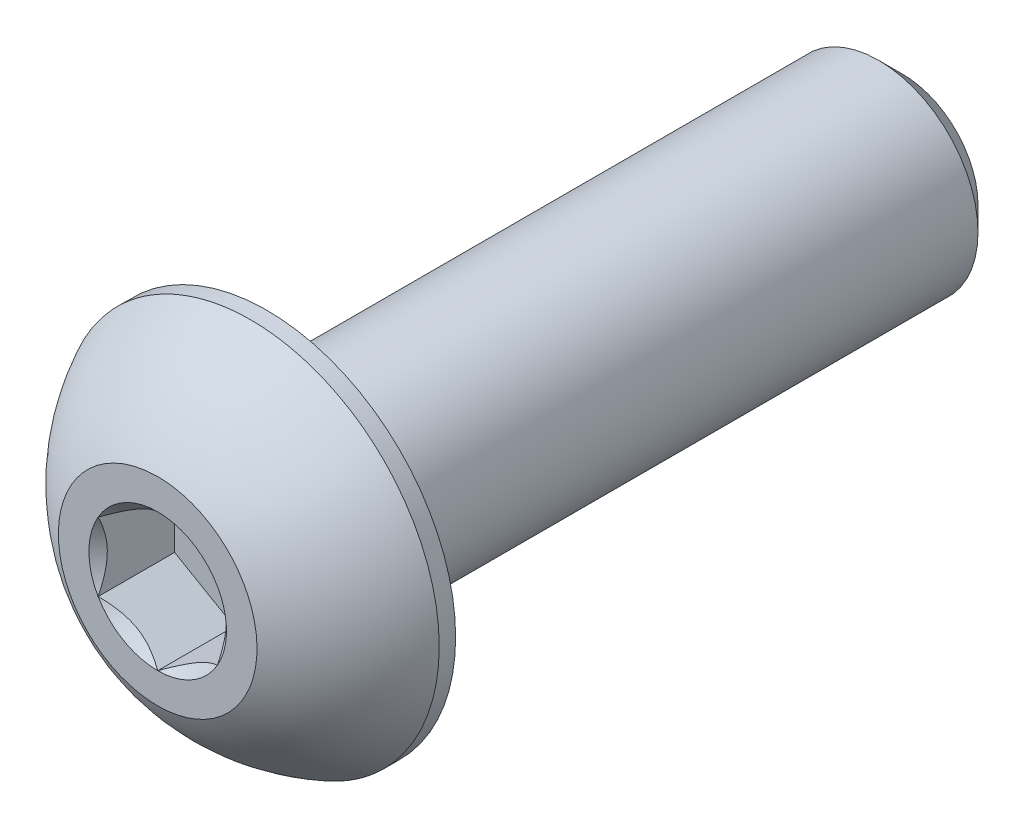
ISO-10303-21;
HEADER;
FILE_DESCRIPTION(('STEP AP214'),'2;1');
FILE_NAME('part.step','',(''),(''),'','','');
FILE_SCHEMA(('AUTOMOTIVE_DESIGN { 1 0 10303 214 1 1 1 1 }'));
ENDSEC;
DATA;
#1=APPLICATION_CONTEXT('core data for automotive mechanical design processes');
#2=APPLICATION_PROTOCOL_DEFINITION('international standard','automotive_design',2000,#1);
#3=PRODUCT_CONTEXT('',#1,'mechanical');
#4=PRODUCT('Part','Part','',(#3));
#5=PRODUCT_RELATED_PRODUCT_CATEGORY('part','',(#4));
#6=PRODUCT_DEFINITION_FORMATION('','',#4);
#7=PRODUCT_DEFINITION_CONTEXT('part definition',#1,'design');
#8=PRODUCT_DEFINITION('design','',#6,#7);
#9=PRODUCT_DEFINITION_SHAPE('','',#8);
#10=(LENGTH_UNIT() NAMED_UNIT(*) SI_UNIT(.MILLI.,.METRE.));
#11=(NAMED_UNIT(*) PLANE_ANGLE_UNIT() SI_UNIT($,.RADIAN.));
#12=(NAMED_UNIT(*) SI_UNIT($,.STERADIAN.) SOLID_ANGLE_UNIT());
#13=UNCERTAINTY_MEASURE_WITH_UNIT(LENGTH_MEASURE(1.E-05),#10,'distance_accuracy_value','');
#14=(GEOMETRIC_REPRESENTATION_CONTEXT(3) GLOBAL_UNCERTAINTY_ASSIGNED_CONTEXT((#13)) GLOBAL_UNIT_ASSIGNED_CONTEXT((#10,
#11,#12)) REPRESENTATION_CONTEXT('',''));
#15=CARTESIAN_POINT('',(0.,0.,0.));
#16=DIRECTION('',(0.,0.,1.));
#17=DIRECTION('',(1.,0.,0.));
#18=AXIS2_PLACEMENT_3D('',#15,#16,#17);
#19=CARTESIAN_POINT('',(1.5,-0.866025403784438,-1.925));
#20=DIRECTION('',(0.,0.,1.));
#21=DIRECTION('',(1.,0.,0.));
#22=AXIS2_PLACEMENT_3D('',#19,#20,#21);
#23=PLANE('',#22);
#24=DIRECTION('',(0.,1.,0.));
#25=VECTOR('',#24,1.);
#26=CARTESIAN_POINT('',(-1.5,0.866025403784438,-1.925));
#27=LINE('',#26,#25);
#28=CARTESIAN_POINT('',(-1.5,0.866025403784439,-1.925));
#29=VERTEX_POINT('',#28);
#30=CARTESIAN_POINT('',(-1.5,-0.866025403784439,-1.925));
#31=VERTEX_POINT('',#30);
#32=EDGE_CURVE('E67',#29,#31,#27,.F.);
#33=ORIENTED_EDGE('',*,*,#32,.T.);
#34=DIRECTION('',(0.866025403784439,-0.5,0.));
#35=VECTOR('',#34,1.);
#36=CARTESIAN_POINT('',(-1.5,-0.866025403784439,-1.925));
#37=LINE('',#36,#35);
#38=CARTESIAN_POINT('',(0.,-1.73205080756888,-1.925));
#39=VERTEX_POINT('',#38);
#40=EDGE_CURVE('E81',#31,#39,#37,.T.);
#41=ORIENTED_EDGE('',*,*,#40,.T.);
#42=DIRECTION('',(0.866025403784438,0.5,0.));
#43=VECTOR('',#42,1.);
#44=CARTESIAN_POINT('',(0.,-1.73205080756888,-1.925));
#45=LINE('',#44,#43);
#46=CARTESIAN_POINT('',(1.5,-0.866025403784439,-1.925));
#47=VERTEX_POINT('',#46);
#48=EDGE_CURVE('E84',#39,#47,#45,.T.);
#49=ORIENTED_EDGE('',*,*,#48,.T.);
#50=DIRECTION('',(0.,1.,0.));
#51=VECTOR('',#50,1.);
#52=CARTESIAN_POINT('',(1.5,-0.866025403784438,-1.925));
#53=LINE('',#52,#51);
#54=CARTESIAN_POINT('',(1.5,0.866025403784439,-1.925));
#55=VERTEX_POINT('',#54);
#56=EDGE_CURVE('E93',#47,#55,#53,.T.);
#57=ORIENTED_EDGE('',*,*,#56,.T.);
#58=DIRECTION('',(-0.866025403784439,0.5,0.));
#59=VECTOR('',#58,1.);
#60=CARTESIAN_POINT('',(1.5,0.866025403784439,-1.925));
#61=LINE('',#60,#59);
#62=CARTESIAN_POINT('',(0.,1.73205080756888,-1.925));
#63=VERTEX_POINT('',#62);
#64=EDGE_CURVE('E265',#55,#63,#61,.T.);
#65=ORIENTED_EDGE('',*,*,#64,.T.);
#66=DIRECTION('',(-0.866025403784438,-0.5,0.));
#67=VECTOR('',#66,1.);
#68=CARTESIAN_POINT('',(0.,1.73205080756888,-1.925));
#69=LINE('',#68,#67);
#70=EDGE_CURVE('E72',#63,#29,#69,.T.);
#71=ORIENTED_EDGE('',*,*,#70,.T.);
#72=EDGE_LOOP('',(#33,#41,#49,#57,#65,#71));
#73=FACE_BOUND('',#72,.T.);
#74=ADVANCED_FACE('F17',(#73),#23,.T.);
#75=CARTESIAN_POINT('',(-1.5,-0.866025403784439,-1.925));
#76=DIRECTION('',(-0.5,-0.866025403784439,0.));
#77=DIRECTION('',(0.866025403784439,-0.5,0.));
#78=AXIS2_PLACEMENT_3D('',#75,#76,#77);
#79=PLANE('',#78);
#80=CARTESIAN_POINT('',(-1.50000000002453,-0.866025403770048,-3.49730883349403E-11));
#81=CARTESIAN_POINT('',(-1.44844426727117,-0.895791119953617,-0.0297371504849993));
#82=CARTESIAN_POINT('',(-1.39602652187328,-0.926054519369461,-0.0577274997332096));
#83=CARTESIAN_POINT('',(-1.28914135977816,-0.9877646964775,-0.108976634295228));
#84=CARTESIAN_POINT('',(-1.23466378385068,-1.01921733960401,-0.132206913925155));
#85=CARTESIAN_POINT('',(-1.12481242363947,-1.08264005199279,-0.172000539063643));
#86=CARTESIAN_POINT('',(-1.06946660011449,-1.11459397810346,-0.188663877355987));
#87=CARTESIAN_POINT('',(-0.95755685533188,-1.17920509937865,-0.214336924391904));
#88=CARTESIAN_POINT('',(-0.900996350293105,-1.21186032218828,-0.223365789908325));
#89=CARTESIAN_POINT('',(-0.803509072843295,-1.26814462806649,-0.231512589340654));
#90=CARTESIAN_POINT('',(-0.762708138141556,-1.29170105869973,-0.232718117543908));
#91=CARTESIAN_POINT('',(-0.68117834074718,-1.33877230917235,-0.230683861819339));
#92=CARTESIAN_POINT('',(-0.640449495964758,-1.36228711867126,-0.22744309593466));
#93=CARTESIAN_POINT('',(-0.559384065201953,-1.40909026694414,-0.216702694706976));
#94=CARTESIAN_POINT('',(-0.51904787950441,-1.4323783746147,-0.20919909909419));
#95=CARTESIAN_POINT('',(-0.439052551258332,-1.47856369891149,-0.19034052638936));
#96=CARTESIAN_POINT('',(-0.399393706909126,-1.50146074337225,-0.178983896683506));
#97=CARTESIAN_POINT('',(-0.297850129661508,-1.56008695503064,-0.145281418581615));
#98=CARTESIAN_POINT('',(-0.236594120185608,-1.59545312859103,-0.120399016466317));
#99=CARTESIAN_POINT('',(-0.146523888893023,-1.64745520087378,-0.0783962697862533));
#100=CARTESIAN_POINT('',(-0.116842951449675,-1.6645914980965,-0.0636393457173694));
#101=CARTESIAN_POINT('',(-0.0580266310224323,-1.69854911652791,-0.0327784720806824));
#102=CARTESIAN_POINT('',(-0.0288909964375011,-1.71537058299853,-0.0166751634684283));
#103=CARTESIAN_POINT('',(2.46562120663875E-11,-1.73205080758311,-3.5066995750627E-11));
#104=B_SPLINE_CURVE_WITH_KNOTS('',3,(#80,#81,#82,#83,#84,#85,#86,#87,#88,#89,#90,#91,#92,#93,
#94,#95,#96,#97,#98,#99,#100,#101,#102,#103),.UNSPECIFIED.,.F.,.F.,(4,2,2,2,2,2,2,2,2,2,2,4),
(0.,0.199774419910088,0.4007123122777,0.598459990337994,0.795709985707602,0.936894690871223,
1.07811058146816,1.21945788001607,1.36086588096647,1.58533909988034,1.69726364731887,
1.80913521242832),.UNSPECIFIED.);
#105=CARTESIAN_POINT('',(-1.50000000002135,-0.866025403796764,-2.4651077774769E-11));
#106=VERTEX_POINT('',#105);
#107=CARTESIAN_POINT('',(-3.03592605946672E-11,-1.73205080760065,-1.75295343369276E-11));
#108=VERTEX_POINT('',#107);
#109=EDGE_CURVE('E20',#106,#108,#104,.T.);
#110=ORIENTED_EDGE('',*,*,#109,.T.);
#111=DIRECTION('',(0.,0.,1.));
#112=VECTOR('',#111,1.);
#113=CARTESIAN_POINT('',(0.,-1.73205080756888,-1.925));
#114=LINE('',#113,#112);
#115=EDGE_CURVE('E88',#108,#39,#114,.F.);
#116=ORIENTED_EDGE('',*,*,#115,.T.);
#117=ORIENTED_EDGE('',*,*,#40,.F.);
#118=DIRECTION('',(0.,0.,1.));
#119=VECTOR('',#118,1.);
#120=CARTESIAN_POINT('',(-1.5,-0.866025403784439,-1.925));
#121=LINE('',#120,#119);
#122=EDGE_CURVE('E59',#31,#106,#121,.T.);
#123=ORIENTED_EDGE('',*,*,#122,.T.);
#124=EDGE_LOOP('',(#110,#116,#117,#123));
#125=FACE_BOUND('',#124,.T.);
#126=ADVANCED_FACE('F89',(#125),#79,.F.);
#127=CARTESIAN_POINT('',(0.,-1.73205080756888,-1.925));
#128=DIRECTION('',(0.5,-0.866025403784438,0.));
#129=DIRECTION('',(0.866025403784438,0.5,0.));
#130=AXIS2_PLACEMENT_3D('',#127,#128,#129);
#131=PLANE('',#130);
#132=CARTESIAN_POINT('',(-2.47283241622989E-11,-1.73205080758293,-3.49712886177983E-11));
#133=CARTESIAN_POINT('',(0.0515557327287634,-1.70228509139958,-0.0297371504849972));
#134=CARTESIAN_POINT('',(0.103973478126704,-1.67202169198382,-0.0577274997332075));
#135=CARTESIAN_POINT('',(0.210858640221864,-1.61031151487585,-0.108976634295226));
#136=CARTESIAN_POINT('',(0.265336216149329,-1.57885887174931,-0.132206913925153));
#137=CARTESIAN_POINT('',(0.375187576360524,-1.51543615936052,-0.172000539063641));
#138=CARTESIAN_POINT('',(0.430533399885509,-1.48348223324986,-0.188663877355984));
#139=CARTESIAN_POINT('',(0.542443144668122,-1.41887111197467,-0.214336924391901));
#140=CARTESIAN_POINT('',(0.599003649706896,-1.38621588916504,-0.223365789908323));
#141=CARTESIAN_POINT('',(0.696490927156706,-1.32993158328682,-0.231512589340651));
#142=CARTESIAN_POINT('',(0.737291861858445,-1.30637515265359,-0.232718117543906));
#143=CARTESIAN_POINT('',(0.818821659252821,-1.25930390218097,-0.230683861819337));
#144=CARTESIAN_POINT('',(0.859550504035243,-1.23578909268205,-0.227443095934658));
#145=CARTESIAN_POINT('',(0.940615934798048,-1.18898594440918,-0.216702694706974));
#146=CARTESIAN_POINT('',(0.980952120495591,-1.16569783673862,-0.209199099094188));
#147=CARTESIAN_POINT('',(1.06094744874167,-1.11951251244183,-0.190340526389358));
#148=CARTESIAN_POINT('',(1.10060629309087,-1.09661546798107,-0.178983896683504));
#149=CARTESIAN_POINT('',(1.20214987033849,-1.03798925632268,-0.145281418581614));
#150=CARTESIAN_POINT('',(1.26340587981439,-1.00262308276228,-0.120399016466316));
#151=CARTESIAN_POINT('',(1.35347611110698,-0.950621010479539,-0.0783962697862523));
#152=CARTESIAN_POINT('',(1.38315704855032,-0.933484713256822,-0.0636393457173685));
#153=CARTESIAN_POINT('',(1.44197336897757,-0.89952709482541,-0.0327784720806818));
#154=CARTESIAN_POINT('',(1.4711090035625,-0.882705628354789,-0.0166751634684277));
#155=CARTESIAN_POINT('',(1.50000000002466,-0.866025403770206,-3.50662371950392E-11));
#156=B_SPLINE_CURVE_WITH_KNOTS('',3,(#132,#133,#134,#135,#136,#137,#138,#139,#140,#141,#142,
#143,#144,#145,#146,#147,#148,#149,#150,#151,#152,#153,#154,#155),.UNSPECIFIED.,.F.,.F.,(4,2,2,
2,2,2,2,2,2,2,2,4),(0.,0.199774419910088,0.400712312277699,0.598459990337993,0.795709985707601,
0.936894690871222,1.07811058146816,1.21945788001607,1.36086588096647,1.58533909988034,
1.69726364731887,1.80913521242832),.UNSPECIFIED.);
#157=CARTESIAN_POINT('',(1.50000000001233,-0.866025403826621,-1.7529131224469E-11));
#158=VERTEX_POINT('',#157);
#159=EDGE_CURVE('E202',#108,#158,#156,.T.);
#160=ORIENTED_EDGE('',*,*,#159,.T.);
#161=DIRECTION('',(0.,0.,-1.));
#162=VECTOR('',#161,1.);
#163=CARTESIAN_POINT('',(1.5,-0.866025403784439,-1.925));
#164=LINE('',#163,#162);
#165=EDGE_CURVE('E97',#158,#47,#164,.T.);
#166=ORIENTED_EDGE('',*,*,#165,.T.);
#167=ORIENTED_EDGE('',*,*,#48,.F.);
#168=ORIENTED_EDGE('',*,*,#115,.F.);
#169=EDGE_LOOP('',(#160,#166,#167,#168));
#170=FACE_BOUND('',#169,.T.);
#171=ADVANCED_FACE('F95',(#170),#131,.F.);
#172=CARTESIAN_POINT('',(1.5,-0.866025403784438,-1.925));
#173=DIRECTION('',(1.,0.,0.));
#174=DIRECTION('',(0.,0.,-1.));
#175=AXIS2_PLACEMENT_3D('',#172,#173,#174);
#176=PLANE('',#175);
#177=CARTESIAN_POINT('',(1.4999999999998,-0.866025403812882,-3.49731948477309E-11));
#178=CARTESIAN_POINT('',(1.49999999999993,-0.806493971458483,-0.0297371504859726));
#179=CARTESIAN_POINT('',(1.49999999999998,-0.745967172639481,-0.0577274997356718));
#180=CARTESIAN_POINT('',(1.50000000000002,-0.622546818448653,-0.108976634302055));
#181=CARTESIAN_POINT('',(1.50000000000001,-0.559641532208188,-0.132206913934862));
#182=CARTESIAN_POINT('',(1.5,-0.432796107455125,-0.172000539080811));
#183=CARTESIAN_POINT('',(1.5,-0.368888255245699,-0.188663877377684));
#184=CARTESIAN_POINT('',(1.5,-0.239666012718551,-0.214336924424236));
#185=CARTESIAN_POINT('',(1.5,-0.174355567110582,-0.223365789946761));
#186=CARTESIAN_POINT('',(1.5,-0.0617869553803679,-0.231512589389946));
#187=CARTESIAN_POINT('',(1.5,-0.0146740941290628,-0.232718117598397));
#188=CARTESIAN_POINT('',(1.5,0.0794684067864031,-0.230683861885897));
#189=CARTESIAN_POINT('',(1.5,0.126498025769629,-0.227443096008093));
#190=CARTESIAN_POINT('',(1.5,0.22010432228685,-0.21670269479537));
#191=CARTESIAN_POINT('',(1.5,0.266680537614034,-0.209199099190673));
#192=CARTESIAN_POINT('',(1.5,0.359051186180354,-0.190340526502742));
#193=CARTESIAN_POINT('',(1.5,0.404845275088565,-0.178983896805698));
#194=CARTESIAN_POINT('',(1.5,0.522097698449399,-0.145281418704612));
#195=CARTESIAN_POINT('',(1.5,0.592830045625335,-0.120399016572433));
#196=CARTESIAN_POINT('',(1.5,0.69683419026976,-0.0783962698582894));
#197=CARTESIAN_POINT('',(1.5,0.731106784740956,-0.0636393457765502));
#198=CARTESIAN_POINT('',(1.5,0.799022021654026,-0.0327784721118594));
#199=CARTESIAN_POINT('',(1.5,0.832664954619755,-0.0166751634844621));
#200=CARTESIAN_POINT('',(1.5,0.866025403812908,-3.5067301240063E-11));
#201=B_SPLINE_CURVE_WITH_KNOTS('',3,(#177,#178,#179,#180,#181,#182,#183,#184,#185,#186,#187,
#188,#189,#190,#191,#192,#193,#194,#195,#196,#197,#198,#199,#200),.UNSPECIFIED.,.F.,.F.,(4,2,2,
2,2,2,2,2,2,2,2,4),(0.,0.199774419877746,0.400712312213007,0.598459990242251,0.795709985580833,
0.936894690699465,1.07811058125136,1.21945787975417,1.36086588065946,1.58533909974464,
1.69726364726936,1.80913521246463),.UNSPECIFIED.);
#202=CARTESIAN_POINT('',(1.5000000000427,0.866025403774031,-1.75296331798823E-11));
#203=VERTEX_POINT('',#202);
#204=EDGE_CURVE('E184',#158,#203,#201,.T.);
#205=ORIENTED_EDGE('',*,*,#204,.T.);
#206=DIRECTION('',(0.,0.,1.));
#207=VECTOR('',#206,1.);
#208=CARTESIAN_POINT('',(1.5,0.866025403784439,-1.925));
#209=LINE('',#208,#207);
#210=EDGE_CURVE('E262',#203,#55,#209,.F.);
#211=ORIENTED_EDGE('',*,*,#210,.T.);
#212=ORIENTED_EDGE('',*,*,#56,.F.);
#213=ORIENTED_EDGE('',*,*,#165,.F.);
#214=EDGE_LOOP('',(#205,#211,#212,#213));
#215=FACE_BOUND('',#214,.T.);
#216=ADVANCED_FACE('F174',(#215),#176,.F.);
#217=CARTESIAN_POINT('',(1.5,0.866025403784439,-1.925));
#218=DIRECTION('',(0.5,0.866025403784439,0.));
#219=DIRECTION('',(-0.866025403784439,0.5,0.));
#220=AXIS2_PLACEMENT_3D('',#217,#218,#219);
#221=PLANE('',#220);
#222=CARTESIAN_POINT('',(1.50000000002453,0.866025403770048,-3.4973253111955E-11));
#223=CARTESIAN_POINT('',(1.44844426727117,0.895791119953617,-0.0297371504849994));
#224=CARTESIAN_POINT('',(1.39602652187328,0.926054519369461,-0.0577274997332097));
#225=CARTESIAN_POINT('',(1.28914135977816,0.987764696477501,-0.108976634295228));
#226=CARTESIAN_POINT('',(1.23466378385068,1.01921733960401,-0.132206913925155));
#227=CARTESIAN_POINT('',(1.12481242363947,1.08264005199279,-0.172000539063643));
#228=CARTESIAN_POINT('',(1.06946660011449,1.11459397810346,-0.188663877355987));
#229=CARTESIAN_POINT('',(0.95755685533188,1.17920509937865,-0.214336924391904));
#230=CARTESIAN_POINT('',(0.900996350293104,1.21186032218828,-0.223365789908325));
#231=CARTESIAN_POINT('',(0.803509072843295,1.26814462806649,-0.231512589340654));
#232=CARTESIAN_POINT('',(0.762708138141556,1.29170105869973,-0.232718117543908));
#233=CARTESIAN_POINT('',(0.68117834074718,1.33877230917235,-0.230683861819339));
#234=CARTESIAN_POINT('',(0.640449495964758,1.36228711867126,-0.22744309593466));
#235=CARTESIAN_POINT('',(0.559384065201953,1.40909026694414,-0.216702694706976));
#236=CARTESIAN_POINT('',(0.51904787950441,1.4323783746147,-0.20919909909419));
#237=CARTESIAN_POINT('',(0.439052551258333,1.47856369891149,-0.19034052638936));
#238=CARTESIAN_POINT('',(0.399393706909126,1.50146074337225,-0.178983896683506));
#239=CARTESIAN_POINT('',(0.297850129661507,1.56008695503064,-0.145281418581616));
#240=CARTESIAN_POINT('',(0.236594120185608,1.59545312859103,-0.120399016466317));
#241=CARTESIAN_POINT('',(0.146523888893023,1.64745520087378,-0.0783962697862531));
#242=CARTESIAN_POINT('',(0.116842951449674,1.6645914980965,-0.0636393457173692));
#243=CARTESIAN_POINT('',(0.0580266310224316,1.69854911652791,-0.0327784720806821));
#244=CARTESIAN_POINT('',(0.0288909964375004,1.71537058299853,-0.0166751634684281));
#245=CARTESIAN_POINT('',(-2.46568834570738E-11,1.73205080758311,-3.50665978158375E-11));
#246=B_SPLINE_CURVE_WITH_KNOTS('',3,(#222,#223,#224,#225,#226,#227,#228,#229,#230,#231,#232,
#233,#234,#235,#236,#237,#238,#239,#240,#241,#242,#243,#244,#245),.UNSPECIFIED.,.F.,.F.,(4,2,2,
2,2,2,2,2,2,2,2,4),(0.,0.199774419910088,0.400712312277699,0.598459990337994,0.795709985707602,
0.936894690871222,1.07811058146816,1.21945788001607,1.36086588096647,1.58533909988034,
1.69726364731887,1.80913521242832),.UNSPECIFIED.);
#247=CARTESIAN_POINT('',(3.03590397906963E-11,1.73205080760065,-1.75294164449582E-11));
#248=VERTEX_POINT('',#247);
#249=EDGE_CURVE('E178',#203,#248,#246,.T.);
#250=ORIENTED_EDGE('',*,*,#249,.T.);
#251=DIRECTION('',(0.,0.,1.));
#252=VECTOR('',#251,1.);
#253=CARTESIAN_POINT('',(0.,1.73205080756888,-1.925));
#254=LINE('',#253,#252);
#255=EDGE_CURVE('E257',#248,#63,#254,.F.);
#256=ORIENTED_EDGE('',*,*,#255,.T.);
#257=ORIENTED_EDGE('',*,*,#64,.F.);
#258=ORIENTED_EDGE('',*,*,#210,.F.);
#259=EDGE_LOOP('',(#250,#256,#257,#258));
#260=FACE_BOUND('',#259,.T.);
#261=ADVANCED_FACE('F170',(#260),#221,.F.);
#262=CARTESIAN_POINT('',(0.,1.73205080756888,-1.925));
#263=DIRECTION('',(-0.5,0.866025403784438,0.));
#264=DIRECTION('',(-0.866025403784438,-0.5,0.));
#265=AXIS2_PLACEMENT_3D('',#262,#263,#264);
#266=PLANE('',#265);
#267=CARTESIAN_POINT('',(2.47278634993487E-11,1.73205080758293,-3.49716904690521E-11));
#268=CARTESIAN_POINT('',(-0.0515557327287638,1.70228509139958,-0.0297371504849977));
#269=CARTESIAN_POINT('',(-0.103973478126705,1.67202169198382,-0.0577274997332079));
#270=CARTESIAN_POINT('',(-0.210858640221864,1.61031151487585,-0.108976634295226));
#271=CARTESIAN_POINT('',(-0.26533621614933,1.57885887174931,-0.132206913925153));
#272=CARTESIAN_POINT('',(-0.375187576360525,1.51543615936052,-0.172000539063641));
#273=CARTESIAN_POINT('',(-0.430533399885509,1.48348223324986,-0.188663877355985));
#274=CARTESIAN_POINT('',(-0.542443144668123,1.41887111197467,-0.214336924391901));
#275=CARTESIAN_POINT('',(-0.599003649706897,1.38621588916504,-0.223365789908323));
#276=CARTESIAN_POINT('',(-0.696490927156706,1.32993158328682,-0.231512589340651));
#277=CARTESIAN_POINT('',(-0.737291861858445,1.30637515265359,-0.232718117543906));
#278=CARTESIAN_POINT('',(-0.818821659252822,1.25930390218097,-0.230683861819337));
#279=CARTESIAN_POINT('',(-0.859550504035244,1.23578909268205,-0.227443095934658));
#280=CARTESIAN_POINT('',(-0.940615934798048,1.18898594440918,-0.216702694706974));
#281=CARTESIAN_POINT('',(-0.980952120495591,1.16569783673862,-0.209199099094188));
#282=CARTESIAN_POINT('',(-1.06094744874167,1.11951251244183,-0.190340526389358));
#283=CARTESIAN_POINT('',(-1.10060629309088,1.09661546798107,-0.178983896683504));
#284=CARTESIAN_POINT('',(-1.20214987033849,1.03798925632268,-0.145281418581613));
#285=CARTESIAN_POINT('',(-1.26340587981439,1.00262308276228,-0.120399016466315));
#286=CARTESIAN_POINT('',(-1.35347611110698,0.950621010479539,-0.0783962697862516));
#287=CARTESIAN_POINT('',(-1.38315704855033,0.933484713256821,-0.0636393457173678));
#288=CARTESIAN_POINT('',(-1.44197336897757,0.899527094825409,-0.0327784720806811));
#289=CARTESIAN_POINT('',(-1.4711090035625,0.882705628354789,-0.0166751634684272));
#290=CARTESIAN_POINT('',(-1.50000000002466,0.866025403770206,-3.50659196153753E-11));
#291=B_SPLINE_CURVE_WITH_KNOTS('',3,(#267,#268,#269,#270,#271,#272,#273,#274,#275,#276,#277,
#278,#279,#280,#281,#282,#283,#284,#285,#286,#287,#288,#289,#290),.UNSPECIFIED.,.F.,.F.,(4,2,2,
2,2,2,2,2,2,2,2,4),(0.,0.199774419910088,0.400712312277699,0.598459990337993,0.795709985707601,
0.936894690871222,1.07811058146816,1.21945788001607,1.36086588096647,1.58533909988034,
1.69726364731887,1.80913521242832),.UNSPECIFIED.);
#292=CARTESIAN_POINT('',(-1.50000000001233,0.86602540382662,-1.75290210342841E-11));
#293=VERTEX_POINT('',#292);
#294=EDGE_CURVE('E40',#248,#293,#291,.T.);
#295=ORIENTED_EDGE('',*,*,#294,.T.);
#296=DIRECTION('',(0.,0.,1.));
#297=VECTOR('',#296,1.);
#298=CARTESIAN_POINT('',(-1.5,0.866025403784438,-1.925));
#299=LINE('',#298,#297);
#300=EDGE_CURVE('E250',#293,#29,#299,.F.);
#301=ORIENTED_EDGE('',*,*,#300,.T.);
#302=ORIENTED_EDGE('',*,*,#70,.F.);
#303=ORIENTED_EDGE('',*,*,#255,.F.);
#304=EDGE_LOOP('',(#295,#301,#302,#303));
#305=FACE_BOUND('',#304,.T.);
#306=ADVANCED_FACE('F163',(#305),#266,.F.);
#307=CARTESIAN_POINT('',(-1.5,0.866025403784438,-1.925));
#308=DIRECTION('',(-1.,0.,0.));
#309=DIRECTION('',(0.,0.,1.));
#310=AXIS2_PLACEMENT_3D('',#307,#308,#309);
#311=PLANE('',#310);
#312=CARTESIAN_POINT('',(-1.4999999999998,0.866025403812881,-3.49736894377255E-11));
#313=CARTESIAN_POINT('',(-1.49999999999993,0.806493971458482,-0.0297371504859727));
#314=CARTESIAN_POINT('',(-1.49999999999998,0.74596717263948,-0.0577274997356719));
#315=CARTESIAN_POINT('',(-1.50000000000002,0.622546818448652,-0.108976634302056));
#316=CARTESIAN_POINT('',(-1.50000000000001,0.559641532208187,-0.132206913934863));
#317=CARTESIAN_POINT('',(-1.5,0.432796107455124,-0.172000539080812));
#318=CARTESIAN_POINT('',(-1.5,0.368888255245698,-0.188663877377684));
#319=CARTESIAN_POINT('',(-1.5,0.23966601271855,-0.214336924424236));
#320=CARTESIAN_POINT('',(-1.5,0.174355567110582,-0.223365789946761));
#321=CARTESIAN_POINT('',(-1.5,0.0617869553803675,-0.231512589389946));
#322=CARTESIAN_POINT('',(-1.5,0.0146740941290625,-0.232718117598397));
#323=CARTESIAN_POINT('',(-1.5,-0.0794684067864032,-0.230683861885897));
#324=CARTESIAN_POINT('',(-1.5,-0.126498025769629,-0.227443096008093));
#325=CARTESIAN_POINT('',(-1.5,-0.22010432228685,-0.21670269479537));
#326=CARTESIAN_POINT('',(-1.5,-0.266680537614034,-0.209199099190673));
#327=CARTESIAN_POINT('',(-1.5,-0.359051186180354,-0.190340526502742));
#328=CARTESIAN_POINT('',(-1.5,-0.404845275088566,-0.178983896805698));
#329=CARTESIAN_POINT('',(-1.5,-0.522097698449399,-0.145281418704612));
#330=CARTESIAN_POINT('',(-1.5,-0.592830045625335,-0.120399016572433));
#331=CARTESIAN_POINT('',(-1.5,-0.69683419026976,-0.0783962698582894));
#332=CARTESIAN_POINT('',(-1.5,-0.731106784740956,-0.0636393457765503));
#333=CARTESIAN_POINT('',(-1.5,-0.799022021654026,-0.0327784721118596));
#334=CARTESIAN_POINT('',(-1.5,-0.832664954619755,-0.0166751634844622));
#335=CARTESIAN_POINT('',(-1.5,-0.866025403812908,-3.50673251714009E-11));
#336=B_SPLINE_CURVE_WITH_KNOTS('',3,(#312,#313,#314,#315,#316,#317,#318,#319,#320,#321,#322,
#323,#324,#325,#326,#327,#328,#329,#330,#331,#332,#333,#334,#335),.UNSPECIFIED.,.F.,.F.,(4,2,2,
2,2,2,2,2,2,2,2,4),(0.,0.199774419877746,0.400712312213007,0.598459990242251,0.795709985580833,
0.936894690699464,1.07811058125136,1.21945787975417,1.36086588065945,1.58533909974464,
1.69726364726936,1.80913521246463),.UNSPECIFIED.);
#337=EDGE_CURVE('E143',#293,#106,#336,.T.);
#338=ORIENTED_EDGE('',*,*,#337,.T.);
#339=ORIENTED_EDGE('',*,*,#122,.F.);
#340=ORIENTED_EDGE('',*,*,#32,.F.);
#341=ORIENTED_EDGE('',*,*,#300,.F.);
#342=EDGE_LOOP('',(#338,#339,#340,#341));
#343=FACE_BOUND('',#342,.T.);
#344=ADVANCED_FACE('F159',(#343),#311,.F.);
#345=CARTESIAN_POINT('',(0.,0.,0.));
#346=DIRECTION('',(0.,0.,1.));
#347=DIRECTION('',(1.,0.,0.));
#348=AXIS2_PLACEMENT_3D('',#345,#346,#347);
#349=CONICAL_SURFACE('',#348,1.73205080761818,0.785398163519197);
#350=ORIENTED_EDGE('',*,*,#109,.F.);
#351=CARTESIAN_POINT('',(0.,0.,0.));
#352=DIRECTION('',(0.,0.,1.));
#353=DIRECTION('',(1.,0.,0.));
#354=AXIS2_PLACEMENT_3D('',#351,#352,#353);
#355=CIRCLE('',#354,1.73205080761818);
#356=EDGE_CURVE('E151',#106,#108,#355,.T.);
#357=ORIENTED_EDGE('',*,*,#356,.T.);
#358=EDGE_LOOP('',(#350,#357));
#359=FACE_BOUND('',#358,.T.);
#360=ADVANCED_FACE('F162',(#359),#349,.F.);
#361=CARTESIAN_POINT('',(0.,0.,0.));
#362=DIRECTION('',(0.,0.,1.));
#363=DIRECTION('',(1.,0.,0.));
#364=AXIS2_PLACEMENT_3D('',#361,#362,#363);
#365=CONICAL_SURFACE('',#364,1.73205080761818,0.785398163519197);
#366=ORIENTED_EDGE('',*,*,#159,.F.);
#367=CARTESIAN_POINT('',(0.,0.,0.));
#368=DIRECTION('',(0.,0.,1.));
#369=DIRECTION('',(1.,0.,0.));
#370=AXIS2_PLACEMENT_3D('',#367,#368,#369);
#371=CIRCLE('',#370,1.73205080761818);
#372=EDGE_CURVE('E303',#108,#158,#371,.T.);
#373=ORIENTED_EDGE('',*,*,#372,.T.);
#374=EDGE_LOOP('',(#366,#373));
#375=FACE_BOUND('',#374,.T.);
#376=ADVANCED_FACE('F197',(#375),#365,.F.);
#377=CARTESIAN_POINT('',(0.,0.,0.));
#378=DIRECTION('',(0.,0.,1.));
#379=DIRECTION('',(1.,0.,0.));
#380=AXIS2_PLACEMENT_3D('',#377,#378,#379);
#381=CONICAL_SURFACE('',#380,1.73205080761818,0.785398163397448);
#382=CARTESIAN_POINT('',(0.,0.,0.));
#383=DIRECTION('',(0.,0.,1.));
#384=DIRECTION('',(1.,0.,0.));
#385=AXIS2_PLACEMENT_3D('',#382,#383,#384);
#386=CIRCLE('',#385,1.73205080761818);
#387=EDGE_CURVE('E304',#158,#203,#386,.T.);
#388=ORIENTED_EDGE('',*,*,#387,.T.);
#389=ORIENTED_EDGE('',*,*,#204,.F.);
#390=EDGE_LOOP('',(#388,#389));
#391=FACE_BOUND('',#390,.T.);
#392=ADVANCED_FACE('F193',(#391),#381,.F.);
#393=CARTESIAN_POINT('',(0.,0.,0.));
#394=DIRECTION('',(0.,0.,1.));
#395=DIRECTION('',(1.,0.,0.));
#396=AXIS2_PLACEMENT_3D('',#393,#394,#395);
#397=CONICAL_SURFACE('',#396,1.73205080761818,0.785398163519197);
#398=ORIENTED_EDGE('',*,*,#249,.F.);
#399=CARTESIAN_POINT('',(0.,0.,0.));
#400=DIRECTION('',(0.,0.,1.));
#401=DIRECTION('',(1.,0.,0.));
#402=AXIS2_PLACEMENT_3D('',#399,#400,#401);
#403=CIRCLE('',#402,1.73205080761818);
#404=EDGE_CURVE('E305',#203,#248,#403,.T.);
#405=ORIENTED_EDGE('',*,*,#404,.T.);
#406=EDGE_LOOP('',(#398,#405));
#407=FACE_BOUND('',#406,.T.);
#408=ADVANCED_FACE('F190',(#407),#397,.F.);
#409=CARTESIAN_POINT('',(0.,0.,0.));
#410=DIRECTION('',(0.,0.,1.));
#411=DIRECTION('',(1.,0.,0.));
#412=AXIS2_PLACEMENT_3D('',#409,#410,#411);
#413=CONICAL_SURFACE('',#412,1.73205080761818,0.785398163519197);
#414=ORIENTED_EDGE('',*,*,#294,.F.);
#415=CARTESIAN_POINT('',(0.,0.,0.));
#416=DIRECTION('',(0.,0.,1.));
#417=DIRECTION('',(1.,0.,0.));
#418=AXIS2_PLACEMENT_3D('',#415,#416,#417);
#419=CIRCLE('',#418,1.73205080761818);
#420=EDGE_CURVE('E298',#248,#293,#419,.T.);
#421=ORIENTED_EDGE('',*,*,#420,.T.);
#422=EDGE_LOOP('',(#414,#421));
#423=FACE_BOUND('',#422,.T.);
#424=ADVANCED_FACE('F138',(#423),#413,.F.);
#425=CARTESIAN_POINT('',(0.,0.,0.));
#426=DIRECTION('',(0.,0.,1.));
#427=DIRECTION('',(1.,0.,0.));
#428=AXIS2_PLACEMENT_3D('',#425,#426,#427);
#429=CONICAL_SURFACE('',#428,1.73205080761818,0.785398163397448);
#430=ORIENTED_EDGE('',*,*,#337,.F.);
#431=CARTESIAN_POINT('',(0.,0.,0.));
#432=DIRECTION('',(0.,0.,1.));
#433=DIRECTION('',(1.,0.,0.));
#434=AXIS2_PLACEMENT_3D('',#431,#432,#433);
#435=CIRCLE('',#434,1.73205080761818);
#436=EDGE_CURVE('E123',#293,#106,#435,.T.);
#437=ORIENTED_EDGE('',*,*,#436,.T.);
#438=EDGE_LOOP('',(#430,#437));
#439=FACE_BOUND('',#438,.T.);
#440=ADVANCED_FACE('F133',(#439),#429,.F.);
#441=CARTESIAN_POINT('',(0.,-2.5,0.));
#442=DIRECTION('',(0.,0.,-1.));
#443=DIRECTION('',(-1.,0.,0.));
#444=AXIS2_PLACEMENT_3D('',#441,#442,#443);
#445=PLANE('',#444);
#446=ORIENTED_EDGE('',*,*,#420,.F.);
#447=ORIENTED_EDGE('',*,*,#404,.F.);
#448=ORIENTED_EDGE('',*,*,#387,.F.);
#449=ORIENTED_EDGE('',*,*,#372,.F.);
#450=ORIENTED_EDGE('',*,*,#356,.F.);
#451=ORIENTED_EDGE('',*,*,#436,.F.);
#452=EDGE_LOOP('',(#446,#447,#448,#449,#450,#451));
#453=FACE_BOUND('',#452,.T.);
#454=CARTESIAN_POINT('',(0.,2.5,0.));
#455=CARTESIAN_POINT('',(-0.140426104916171,2.49999377288615,0.));
#456=CARTESIAN_POINT('',(-0.280954031991962,2.48812860484106,3.15786606079497E-13));
#457=CARTESIAN_POINT('',(-0.558139658492382,2.44096074902969,-3.16166902160035E-13));
#458=CARTESIAN_POINT('',(-0.694792493265144,2.40562985309161,-1.1991938830655E-12));
#459=CARTESIAN_POINT('',(-0.960172122561447,2.31253633023374,-1.20166281841789E-12));
#460=CARTESIAN_POINT('',(-1.08890266852496,2.25478441650809,-3.21946211567848E-13));
#461=CARTESIAN_POINT('',(-1.33480476215494,2.11850293856874,3.21866212850881E-13));
#462=CARTESIAN_POINT('',(-1.45197917410753,2.03997854084975,0.));
#463=CARTESIAN_POINT('',(-1.67149637287936,1.86436525899232,0.));
#464=CARTESIAN_POINT('',(-1.77383760642256,1.76727443311113,0.));
#465=CARTESIAN_POINT('',(-1.96077108972063,1.5572853703438,0.));
#466=CARTESIAN_POINT('',(-2.04536264247664,1.44438651299413,0.));
#467=CARTESIAN_POINT('',(-2.19438926048053,1.20599153577204,0.));
#468=CARTESIAN_POINT('',(-2.2588247010994,1.08049565055392,0.));
#469=CARTESIAN_POINT('',(-2.36571190425968,0.820467575206641,0.));
#470=CARTESIAN_POINT('',(-2.40816371100576,0.685935403248265,0.));
#471=CARTESIAN_POINT('',(-2.46987884513361,0.41165323576608,0.));
#472=CARTESIAN_POINT('',(-2.4891421283097,0.271903230295725,0.));
#473=CARTESIAN_POINT('',(-2.50393321907299,-0.00884700938585766,0.));
#474=CARTESIAN_POINT('',(-2.49946106942909,-0.149847241343845,0.));
#475=CARTESIAN_POINT('',(-2.46690834048228,-0.429095661105703,0.));
#476=CARTESIAN_POINT('',(-2.43882775236998,-0.567343847882638,0.));
#477=CARTESIAN_POINT('',(-2.35985521676827,-0.837163810231991,0.));
#478=CARTESIAN_POINT('',(-2.30896324519902,-0.968735578756573,0.));
#479=CARTESIAN_POINT('',(-2.1858126315262,-1.2214675666181,0.));
#480=CARTESIAN_POINT('',(-2.11355399637579,-1.34262778934316,0.));
#481=CARTESIAN_POINT('',(-1.94972129370707,-1.57109730355804,0.));
#482=CARTESIAN_POINT('',(-1.85814723400701,-1.67840660065422,0.));
#483=CARTESIAN_POINT('',(-1.65828316813495,-1.87612814061528,0.));
#484=CARTESIAN_POINT('',(-1.54999315967219,-1.96654038116456,0.));
#485=CARTESIAN_POINT('',(-1.31977122488187,-2.12790126296045,0.));
#486=CARTESIAN_POINT('',(-1.19783929677156,-2.1988499016635,0.));
#487=CARTESIAN_POINT('',(-0.943794829063063,-2.31926953799949,0.));
#488=CARTESIAN_POINT('',(-0.811682289900767,-2.36874053655201,0.));
#489=CARTESIAN_POINT('',(-0.541026888337529,-2.44480055905629,0.));
#490=CARTESIAN_POINT('',(-0.402484026226278,-2.47138958403888,0.));
#491=CARTESIAN_POINT('',(-0.122900797575727,-2.50093087897621,0.));
#492=CARTESIAN_POINT('',(0.018139568963571,-2.50388314893098,3.46961945081868E-13));
#493=CARTESIAN_POINT('',(0.298714091660324,-2.48606712714886,-3.46961960712715E-13));
#494=CARTESIAN_POINT('',(0.438248247749923,-2.46529883434335,-1.29477243391078E-12));
#495=CARTESIAN_POINT('',(0.71184938433979,-2.40063123468837,-1.13730987603765E-12));
#496=CARTESIAN_POINT('',(0.845916364605969,-2.3567319268485,0.));
#497=CARTESIAN_POINT('',(1.10477735834655,-2.24704847617179,0.));
#498=CARTESIAN_POINT('',(1.22957137303277,-2.18126433619494,-1.00916257566668E-12));
#499=CARTESIAN_POINT('',(1.46634390401786,-2.02967864834023,-1.18352788602047E-12));
#500=CARTESIAN_POINT('',(1.57832242207297,-1.94387710320556,-3.16694129312418E-13));
#501=CARTESIAN_POINT('',(1.7862852822064,-1.7546922142879,3.16694257499622E-13));
#502=CARTESIAN_POINT('',(1.8822696178108,-1.6513088633884,0.));
#503=CARTESIAN_POINT('',(2.0555193719421,-1.42989510132749,0.));
#504=CARTESIAN_POINT('',(2.13278478437748,-1.31186468539964,0.));
#505=CARTESIAN_POINT('',(2.2664032406088,-1.06450749101075,0.));
#506=CARTESIAN_POINT('',(2.32275630647994,-0.935180724474359,0.));
#507=CARTESIAN_POINT('',(2.41295047224872,-0.668901974735228,0.));
#508=CARTESIAN_POINT('',(2.4467915805466,-0.531949994377824,0.));
#509=CARTESIAN_POINT('',(2.49100125494042,-0.254308178115884,0.));
#510=CARTESIAN_POINT('',(2.50136977874099,-0.11361833547654,0.));
#511=CARTESIAN_POINT('',(2.49833983643023,0.167504919749226,0.));
#512=CARTESIAN_POINT('',(2.48494141562714,0.307938332823983,0.));
#513=CARTESIAN_POINT('',(2.43475793877014,0.584562794538375,0.));
#514=CARTESIAN_POINT('',(2.39797283569016,0.720753834646847,0.));
#515=CARTESIAN_POINT('',(2.30205936796063,0.98502964653005,0.));
#516=CARTESIAN_POINT('',(2.24293058718862,1.1131142672812,0.));
#517=CARTESIAN_POINT('',(2.10401075902967,1.3575336098139,0.));
#518=CARTESIAN_POINT('',(2.02422052292125,1.47386879269154,0.));
#519=CARTESIAN_POINT('',(1.84625229096995,1.69148114008358,0.));
#520=CARTESIAN_POINT('',(1.74807621990901,1.79275987884252,0.));
#521=CARTESIAN_POINT('',(1.53608575842464,1.97742315380663,0.));
#522=CARTESIAN_POINT('',(1.42226748721669,2.06080323621403,0.));
#523=CARTESIAN_POINT('',(1.18220372565671,2.20730286771332,0.));
#524=CARTESIAN_POINT('',(1.05595232774905,2.27041272419885,0.));
#525=CARTESIAN_POINT('',(0.79474524318476,2.37446817640476,0.));
#526=CARTESIAN_POINT('',(0.659800208998089,2.41544034072841,0.));
#527=CARTESIAN_POINT('',(0.436662637238998,2.46313736176947,0.));
#528=CARTESIAN_POINT('',(0.349919997758221,2.47694359911888,0.));
#529=CARTESIAN_POINT('',(0.175464826042706,2.49537686389633,0.));
#530=CARTESIAN_POINT('',(0.0877522938079665,2.50000389132438,0.));
#531=CARTESIAN_POINT('',(0.,2.5,0.));
#532=B_SPLINE_CURVE_WITH_KNOTS('',3,(#454,#455,#456,#457,#458,#459,#460,#461,#462,#463,#464,
#465,#466,#467,#468,#469,#470,#471,#472,#473,#474,#475,#476,#477,#478,#479,#480,#481,#482,#483,
#484,#485,#486,#487,#488,#489,#490,#491,#492,#493,#494,#495,#496,#497,#498,#499,#500,#501,#502,
#503,#504,#505,#506,#507,#508,#509,#510,#511,#512,#513,#514,#515,#516,#517,#518,#519,#520,#521,
#522,#523,#524,#525,#526,#527,#528,#529,#530,#531),.UNSPECIFIED.,.T.,.F.,(4,2,2,2,2,2,2,2,2,2,2,
2,2,2,2,2,2,2,2,2,2,2,2,2,2,2,2,2,2,2,2,2,2,2,2,2,2,2,4),(0.,0.420958019059748,
0.842422990224611,1.26368682467408,1.68484598149402,2.10604920874208,2.52726897280856,
2.94848089195443,3.36969196412426,3.7909038392729,4.21211495543997,4.63332622878055,
5.05453794675567,5.47574952765963,5.89696093807138,6.31817240620663,6.73938392938708,
7.16059543453285,7.58180692070278,8.00301840687236,8.42422991201778,8.84544143519829,
9.26665290333358,9.68786431374594,10.1090758946506,10.5302876126258,10.9514988859663,
11.3727100021334,11.793921877282,12.2151329494518,12.6363448685977,13.0575646326643,
13.4787678599123,13.8999270167319,14.3211908511815,14.742655822347,15.1636138414069,
15.4266705700074,15.689727298608),.UNSPECIFIED.);
#533=CARTESIAN_POINT('',(0.,2.5,0.));
#534=VERTEX_POINT('',#533);
#535=EDGE_CURVE('E115',#534,#534,#532,.F.);
#536=ORIENTED_EDGE('',*,*,#535,.F.);
#537=EDGE_LOOP('',(#536));
#538=FACE_BOUND('',#537,.T.);
#539=ADVANCED_FACE('F129',(#453,#538),#445,.F.);
#540=CARTESIAN_POINT('',(0.,0.,-4.65805481283422));
#541=DIRECTION('',(0.,-1.,0.));
#542=DIRECTION('',(0.,0.,-1.));
#543=AXIS2_PLACEMENT_3D('',#540,#541,#542);
#544=SPHERICAL_SURFACE('',#543,5.28653711226622);
#545=ORIENTED_EDGE('',*,*,#535,.T.);
#546=EDGE_LOOP('',(#545));
#547=FACE_BOUND('',#546,.T.);
#548=CARTESIAN_POINT('',(0.,0.,-2.3375));
#549=DIRECTION('',(0.,0.,1.));
#550=DIRECTION('',(1.,0.,0.));
#551=AXIS2_PLACEMENT_3D('',#548,#549,#550);
#552=CIRCLE('',#551,4.75);
#553=CARTESIAN_POINT('',(4.75,0.,-2.3375));
#554=VERTEX_POINT('',#553);
#555=EDGE_CURVE('E112',#554,#554,#552,.F.);
#556=ORIENTED_EDGE('',*,*,#555,.F.);
#557=EDGE_LOOP('',(#556));
#558=FACE_BOUND('',#557,.T.);
#559=ADVANCED_FACE('F125',(#547,#558),#544,.T.);
#560=CARTESIAN_POINT('',(0.,-2.5,-18.75));
#561=DIRECTION('',(0.,0.,-1.));
#562=DIRECTION('',(-1.,0.,0.));
#563=AXIS2_PLACEMENT_3D('',#560,#561,#562);
#564=PLANE('',#563);
#565=CARTESIAN_POINT('',(0.,0.,-18.7500000000682));
#566=DIRECTION('',(0.,0.,1.));
#567=DIRECTION('',(1.,0.,0.));
#568=AXIS2_PLACEMENT_3D('',#565,#566,#567);
#569=CIRCLE('',#568,1.89999999992096);
#570=CARTESIAN_POINT('',(1.89999999992096,0.,-18.7500000000682));
#571=VERTEX_POINT('',#570);
#572=EDGE_CURVE('E109',#571,#571,#569,.T.);
#573=ORIENTED_EDGE('',*,*,#572,.F.);
#574=EDGE_LOOP('',(#573));
#575=FACE_BOUND('',#574,.T.);
#576=ADVANCED_FACE('F233',(#575),#564,.T.);
#577=CARTESIAN_POINT('',(0.,0.,0.));
#578=DIRECTION('',(0.,0.,1.));
#579=DIRECTION('',(1.,0.,0.));
#580=AXIS2_PLACEMENT_3D('',#577,#578,#579);
#581=CYLINDRICAL_SURFACE('',#580,4.75);
#582=CARTESIAN_POINT('',(0.,0.,-2.75));
#583=DIRECTION('',(0.,0.,1.));
#584=DIRECTION('',(1.,0.,0.));
#585=AXIS2_PLACEMENT_3D('',#582,#583,#584);
#586=CIRCLE('',#585,4.75);
#587=CARTESIAN_POINT('',(4.75,0.,-2.75));
#588=VERTEX_POINT('',#587);
#589=EDGE_CURVE('E106',#588,#588,#586,.T.);
#590=ORIENTED_EDGE('',*,*,#589,.T.);
#591=EDGE_LOOP('',(#590));
#592=FACE_BOUND('',#591,.T.);
#593=ORIENTED_EDGE('',*,*,#555,.T.);
#594=EDGE_LOOP('',(#593));
#595=FACE_BOUND('',#594,.T.);
#596=ADVANCED_FACE('F230',(#592,#595),#581,.T.);
#597=CARTESIAN_POINT('',(0.,0.,-18.150000000162));
#598=DIRECTION('',(0.,0.,1.));
#599=DIRECTION('',(1.,0.,0.));
#600=AXIS2_PLACEMENT_3D('',#597,#598,#599);
#601=CONICAL_SURFACE('',#600,2.4999999998272,0.785398163397448);
#602=ORIENTED_EDGE('',*,*,#572,.T.);
#603=EDGE_LOOP('',(#602));
#604=FACE_BOUND('',#603,.T.);
#605=CARTESIAN_POINT('',(0.,0.,-18.15));
#606=DIRECTION('',(0.,0.,-1.));
#607=DIRECTION('',(-1.,0.,0.));
#608=AXIS2_PLACEMENT_3D('',#605,#606,#607);
#609=CIRCLE('',#608,2.5);
#610=CARTESIAN_POINT('',(-2.5,0.,-18.15));
#611=VERTEX_POINT('',#610);
#612=EDGE_CURVE('E31',#611,#611,#609,.F.);
#613=ORIENTED_EDGE('',*,*,#612,.F.);
#614=EDGE_LOOP('',(#613));
#615=FACE_BOUND('',#614,.T.);
#616=ADVANCED_FACE('F223',(#604,#615),#601,.T.);
#617=CARTESIAN_POINT('',(0.,-4.75,-2.75));
#618=DIRECTION('',(0.,0.,1.));
#619=DIRECTION('',(1.,0.,0.));
#620=AXIS2_PLACEMENT_3D('',#617,#618,#619);
#621=PLANE('',#620);
#622=CARTESIAN_POINT('',(0.,0.,-2.75));
#623=DIRECTION('',(0.,0.,-1.));
#624=DIRECTION('',(-1.,0.,0.));
#625=AXIS2_PLACEMENT_3D('',#622,#623,#624);
#626=CIRCLE('',#625,2.5);
#627=CARTESIAN_POINT('',(-2.5,0.,-2.75));
#628=VERTEX_POINT('',#627);
#629=EDGE_CURVE('E11',#628,#628,#626,.T.);
#630=ORIENTED_EDGE('',*,*,#629,.F.);
#631=EDGE_LOOP('',(#630));
#632=FACE_BOUND('',#631,.T.);
#633=ORIENTED_EDGE('',*,*,#589,.F.);
#634=EDGE_LOOP('',(#633));
#635=FACE_BOUND('',#634,.T.);
#636=ADVANCED_FACE('F217',(#632,#635),#621,.F.);
#637=CARTESIAN_POINT('',(0.,0.,-18.75));
#638=DIRECTION('',(0.,0.,-1.));
#639=DIRECTION('',(-1.,0.,0.));
#640=AXIS2_PLACEMENT_3D('',#637,#638,#639);
#641=CYLINDRICAL_SURFACE('',#640,2.5);
#642=ORIENTED_EDGE('',*,*,#629,.T.);
#643=EDGE_LOOP('',(#642));
#644=FACE_BOUND('',#643,.T.);
#645=ORIENTED_EDGE('',*,*,#612,.T.);
#646=EDGE_LOOP('',(#645));
#647=FACE_BOUND('',#646,.T.);
#648=ADVANCED_FACE('F215',(#644,#647),#641,.T.);
#649=CLOSED_SHELL('',(#74,#126,#171,#216,#261,#306,#344,#360,#376,#392,#408,#424,#440,#539,#559,
#576,#596,#616,#636,#648));
#650=MANIFOLD_SOLID_BREP('B1',#649);
#651=ADVANCED_BREP_SHAPE_REPRESENTATION('',(#18,#650),#14);
#652=SHAPE_DEFINITION_REPRESENTATION(#9,#651);
ENDSEC;
END-ISO-10303-21;
